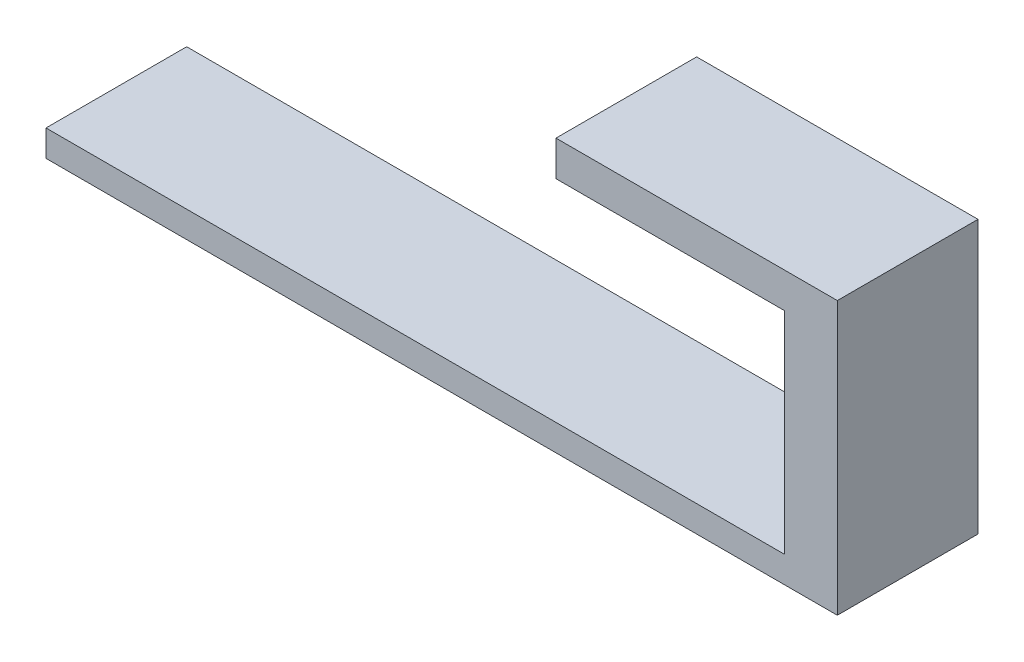
ISO-10303-21;
HEADER;
FILE_DESCRIPTION(('STEP AP214'),'2;1');
FILE_NAME('part.step','',(''),(''),'','','');
FILE_SCHEMA(('AUTOMOTIVE_DESIGN { 1 0 10303 214 1 1 1 1 }'));
ENDSEC;
DATA;
#1=APPLICATION_CONTEXT('core data for automotive mechanical design processes');
#2=APPLICATION_PROTOCOL_DEFINITION('international standard','automotive_design',2000,#1);
#3=PRODUCT_CONTEXT('',#1,'mechanical');
#4=PRODUCT('Part','Part','',(#3));
#5=PRODUCT_RELATED_PRODUCT_CATEGORY('part','',(#4));
#6=PRODUCT_DEFINITION_FORMATION('','',#4);
#7=PRODUCT_DEFINITION_CONTEXT('part definition',#1,'design');
#8=PRODUCT_DEFINITION('design','',#6,#7);
#9=PRODUCT_DEFINITION_SHAPE('','',#8);
#10=(LENGTH_UNIT() NAMED_UNIT(*) SI_UNIT(.MILLI.,.METRE.));
#11=(NAMED_UNIT(*) PLANE_ANGLE_UNIT() SI_UNIT($,.RADIAN.));
#12=(NAMED_UNIT(*) SI_UNIT($,.STERADIAN.) SOLID_ANGLE_UNIT());
#13=UNCERTAINTY_MEASURE_WITH_UNIT(LENGTH_MEASURE(1.E-05),#10,'distance_accuracy_value','');
#14=(GEOMETRIC_REPRESENTATION_CONTEXT(3) GLOBAL_UNCERTAINTY_ASSIGNED_CONTEXT((#13)) GLOBAL_UNIT_ASSIGNED_CONTEXT((#10,
#11,#12)) REPRESENTATION_CONTEXT('',''));
#15=CARTESIAN_POINT('',(0.,0.,0.));
#16=DIRECTION('',(0.,0.,1.));
#17=DIRECTION('',(1.,0.,0.));
#18=AXIS2_PLACEMENT_3D('',#15,#16,#17);
#19=CARTESIAN_POINT('',(19.5,15.5,-4.));
#20=DIRECTION('',(1.,0.,0.));
#21=DIRECTION('',(0.,0.,-1.));
#22=AXIS2_PLACEMENT_3D('',#19,#20,#21);
#23=PLANE('',#22);
#24=DIRECTION('',(0.,0.,1.));
#25=VECTOR('',#24,1.);
#26=CARTESIAN_POINT('',(19.5,13.5,-4.));
#27=LINE('',#26,#25);
#28=CARTESIAN_POINT('',(19.5,13.5,-4.));
#29=VERTEX_POINT('',#28);
#30=CARTESIAN_POINT('',(19.5,13.5,4.));
#31=VERTEX_POINT('',#30);
#32=EDGE_CURVE('E161',#29,#31,#27,.T.);
#33=ORIENTED_EDGE('',*,*,#32,.F.);
#34=DIRECTION('',(0.,-1.,0.));
#35=VECTOR('',#34,1.);
#36=CARTESIAN_POINT('',(19.5,15.5,-4.));
#37=LINE('',#36,#35);
#38=CARTESIAN_POINT('',(19.5,1.5,-4.));
#39=VERTEX_POINT('',#38);
#40=EDGE_CURVE('E48',#29,#39,#37,.T.);
#41=ORIENTED_EDGE('',*,*,#40,.T.);
#42=DIRECTION('',(0.,0.,1.));
#43=VECTOR('',#42,1.);
#44=CARTESIAN_POINT('',(19.5,1.5,-4.));
#45=LINE('',#44,#43);
#46=CARTESIAN_POINT('',(19.5,1.5,4.));
#47=VERTEX_POINT('',#46);
#48=EDGE_CURVE('E163',#39,#47,#45,.T.);
#49=ORIENTED_EDGE('',*,*,#48,.T.);
#50=DIRECTION('',(0.,-1.,0.));
#51=VECTOR('',#50,1.);
#52=CARTESIAN_POINT('',(19.5,15.5,4.));
#53=LINE('',#52,#51);
#54=EDGE_CURVE('E104',#31,#47,#53,.T.);
#55=ORIENTED_EDGE('',*,*,#54,.F.);
#56=EDGE_LOOP('',(#33,#41,#49,#55));
#57=FACE_BOUND('',#56,.T.);
#58=ADVANCED_FACE('F33',(#57),#23,.F.);
#59=CARTESIAN_POINT('',(0.,1.5,0.));
#60=DIRECTION('',(0.,-1.,0.));
#61=DIRECTION('',(0.,0.,-1.));
#62=AXIS2_PLACEMENT_3D('',#59,#60,#61);
#63=PLANE('',#62);
#64=ORIENTED_EDGE('',*,*,#48,.F.);
#65=DIRECTION('',(-1.,0.,0.));
#66=VECTOR('',#65,1.);
#67=CARTESIAN_POINT('',(-22.5,1.5,-4.));
#68=LINE('',#67,#66);
#69=CARTESIAN_POINT('',(-22.5,1.5,-4.));
#70=VERTEX_POINT('',#69);
#71=EDGE_CURVE('E88',#39,#70,#68,.T.);
#72=ORIENTED_EDGE('',*,*,#71,.T.);
#73=DIRECTION('',(0.,0.,1.));
#74=VECTOR('',#73,1.);
#75=CARTESIAN_POINT('',(-22.5,1.5,4.));
#76=LINE('',#75,#74);
#77=CARTESIAN_POINT('',(-22.5,1.5,4.));
#78=VERTEX_POINT('',#77);
#79=EDGE_CURVE('E57',#70,#78,#76,.T.);
#80=ORIENTED_EDGE('',*,*,#79,.T.);
#81=DIRECTION('',(1.,0.,0.));
#82=VECTOR('',#81,1.);
#83=CARTESIAN_POINT('',(-22.5,1.5,4.));
#84=LINE('',#83,#82);
#85=EDGE_CURVE('E98',#78,#47,#84,.T.);
#86=ORIENTED_EDGE('',*,*,#85,.T.);
#87=EDGE_LOOP('',(#64,#72,#80,#86));
#88=FACE_BOUND('',#87,.T.);
#89=ADVANCED_FACE('F174',(#88),#63,.F.);
#90=CARTESIAN_POINT('',(22.5,1.5,4.));
#91=DIRECTION('',(-1.,0.,0.));
#92=DIRECTION('',(0.,0.,1.));
#93=AXIS2_PLACEMENT_3D('',#90,#91,#92);
#94=PLANE('',#93);
#95=DIRECTION('',(0.,0.,-1.));
#96=VECTOR('',#95,1.);
#97=CARTESIAN_POINT('',(22.5,0.,4.));
#98=LINE('',#97,#96);
#99=CARTESIAN_POINT('',(22.5,0.,4.));
#100=VERTEX_POINT('',#99);
#101=CARTESIAN_POINT('',(22.5,0.,-4.));
#102=VERTEX_POINT('',#101);
#103=EDGE_CURVE('E95',#100,#102,#98,.T.);
#104=ORIENTED_EDGE('',*,*,#103,.T.);
#105=DIRECTION('',(0.,-1.,0.));
#106=VECTOR('',#105,1.);
#107=CARTESIAN_POINT('',(22.5,1.5,-4.));
#108=LINE('',#107,#106);
#109=CARTESIAN_POINT('',(22.5,15.5,-4.));
#110=VERTEX_POINT('',#109);
#111=EDGE_CURVE('E11',#110,#102,#108,.T.);
#112=ORIENTED_EDGE('',*,*,#111,.F.);
#113=DIRECTION('',(0.,0.,-1.));
#114=VECTOR('',#113,1.);
#115=CARTESIAN_POINT('',(22.5,15.5,-4.));
#116=LINE('',#115,#114);
#117=CARTESIAN_POINT('',(22.5,15.5,4.));
#118=VERTEX_POINT('',#117);
#119=EDGE_CURVE('E97',#118,#110,#116,.T.);
#120=ORIENTED_EDGE('',*,*,#119,.F.);
#121=DIRECTION('',(0.,-1.,0.));
#122=VECTOR('',#121,1.);
#123=CARTESIAN_POINT('',(22.5,1.5,4.));
#124=LINE('',#123,#122);
#125=EDGE_CURVE('E81',#118,#100,#124,.T.);
#126=ORIENTED_EDGE('',*,*,#125,.T.);
#127=EDGE_LOOP('',(#104,#112,#120,#126));
#128=FACE_BOUND('',#127,.T.);
#129=ADVANCED_FACE('F35',(#128),#94,.F.);
#130=CARTESIAN_POINT('',(-22.5,1.5,-4.));
#131=DIRECTION('',(0.,0.,1.));
#132=DIRECTION('',(1.,0.,0.));
#133=AXIS2_PLACEMENT_3D('',#130,#131,#132);
#134=PLANE('',#133);
#135=DIRECTION('',(-1.,0.,0.));
#136=VECTOR('',#135,1.);
#137=CARTESIAN_POINT('',(-22.5,0.,-4.));
#138=LINE('',#137,#136);
#139=CARTESIAN_POINT('',(-22.5,0.,-4.));
#140=VERTEX_POINT('',#139);
#141=EDGE_CURVE('E101',#102,#140,#138,.T.);
#142=ORIENTED_EDGE('',*,*,#141,.T.);
#143=DIRECTION('',(0.,-1.,0.));
#144=VECTOR('',#143,1.);
#145=CARTESIAN_POINT('',(-22.5,1.5,-4.));
#146=LINE('',#145,#144);
#147=EDGE_CURVE('E41',#70,#140,#146,.T.);
#148=ORIENTED_EDGE('',*,*,#147,.F.);
#149=ORIENTED_EDGE('',*,*,#71,.F.);
#150=ORIENTED_EDGE('',*,*,#40,.F.);
#151=DIRECTION('',(1.,0.,0.));
#152=VECTOR('',#151,1.);
#153=CARTESIAN_POINT('',(6.5,13.5,-4.));
#154=LINE('',#153,#152);
#155=CARTESIAN_POINT('',(6.5,13.5,-4.));
#156=VERTEX_POINT('',#155);
#157=EDGE_CURVE('E148',#156,#29,#154,.T.);
#158=ORIENTED_EDGE('',*,*,#157,.F.);
#159=DIRECTION('',(0.,-1.,0.));
#160=VECTOR('',#159,1.);
#161=CARTESIAN_POINT('',(6.5,15.5,-4.));
#162=LINE('',#161,#160);
#163=CARTESIAN_POINT('',(6.5,15.5,-4.));
#164=VERTEX_POINT('',#163);
#165=EDGE_CURVE('E155',#164,#156,#162,.T.);
#166=ORIENTED_EDGE('',*,*,#165,.F.);
#167=DIRECTION('',(-1.,0.,0.));
#168=VECTOR('',#167,1.);
#169=CARTESIAN_POINT('',(22.5,15.5,-4.));
#170=LINE('',#169,#168);
#171=EDGE_CURVE('E121',#110,#164,#170,.T.);
#172=ORIENTED_EDGE('',*,*,#171,.F.);
#173=ORIENTED_EDGE('',*,*,#111,.T.);
#174=EDGE_LOOP('',(#142,#148,#149,#150,#158,#166,#172,#173));
#175=FACE_BOUND('',#174,.T.);
#176=ADVANCED_FACE('F116',(#175),#134,.F.);
#177=CARTESIAN_POINT('',(-22.5,1.5,4.));
#178=DIRECTION('',(1.,0.,0.));
#179=DIRECTION('',(0.,0.,-1.));
#180=AXIS2_PLACEMENT_3D('',#177,#178,#179);
#181=PLANE('',#180);
#182=DIRECTION('',(0.,0.,1.));
#183=VECTOR('',#182,1.);
#184=CARTESIAN_POINT('',(-22.5,0.,4.));
#185=LINE('',#184,#183);
#186=CARTESIAN_POINT('',(-22.5,0.,4.));
#187=VERTEX_POINT('',#186);
#188=EDGE_CURVE('E89',#140,#187,#185,.T.);
#189=ORIENTED_EDGE('',*,*,#188,.T.);
#190=DIRECTION('',(0.,-1.,0.));
#191=VECTOR('',#190,1.);
#192=CARTESIAN_POINT('',(-22.5,1.5,4.));
#193=LINE('',#192,#191);
#194=EDGE_CURVE('E84',#78,#187,#193,.T.);
#195=ORIENTED_EDGE('',*,*,#194,.F.);
#196=ORIENTED_EDGE('',*,*,#79,.F.);
#197=ORIENTED_EDGE('',*,*,#147,.T.);
#198=EDGE_LOOP('',(#189,#195,#196,#197));
#199=FACE_BOUND('',#198,.T.);
#200=ADVANCED_FACE('F113',(#199),#181,.F.);
#201=CARTESIAN_POINT('',(-22.5,1.5,4.));
#202=DIRECTION('',(0.,0.,-1.));
#203=DIRECTION('',(-1.,0.,0.));
#204=AXIS2_PLACEMENT_3D('',#201,#202,#203);
#205=PLANE('',#204);
#206=DIRECTION('',(1.,0.,0.));
#207=VECTOR('',#206,1.);
#208=CARTESIAN_POINT('',(-22.5,0.,4.));
#209=LINE('',#208,#207);
#210=EDGE_CURVE('E77',#187,#100,#209,.T.);
#211=ORIENTED_EDGE('',*,*,#210,.T.);
#212=ORIENTED_EDGE('',*,*,#125,.F.);
#213=DIRECTION('',(1.,0.,0.));
#214=VECTOR('',#213,1.);
#215=CARTESIAN_POINT('',(22.5,15.5,4.));
#216=LINE('',#215,#214);
#217=CARTESIAN_POINT('',(6.5,15.5,4.));
#218=VERTEX_POINT('',#217);
#219=EDGE_CURVE('E171',#218,#118,#216,.T.);
#220=ORIENTED_EDGE('',*,*,#219,.F.);
#221=DIRECTION('',(0.,1.,0.));
#222=VECTOR('',#221,1.);
#223=CARTESIAN_POINT('',(6.5,15.5,4.));
#224=LINE('',#223,#222);
#225=CARTESIAN_POINT('',(6.5,13.5,4.));
#226=VERTEX_POINT('',#225);
#227=EDGE_CURVE('E154',#226,#218,#224,.T.);
#228=ORIENTED_EDGE('',*,*,#227,.F.);
#229=DIRECTION('',(1.,0.,0.));
#230=VECTOR('',#229,1.);
#231=CARTESIAN_POINT('',(6.5,13.5,4.));
#232=LINE('',#231,#230);
#233=EDGE_CURVE('E150',#226,#31,#232,.T.);
#234=ORIENTED_EDGE('',*,*,#233,.T.);
#235=ORIENTED_EDGE('',*,*,#54,.T.);
#236=ORIENTED_EDGE('',*,*,#85,.F.);
#237=ORIENTED_EDGE('',*,*,#194,.T.);
#238=EDGE_LOOP('',(#211,#212,#220,#228,#234,#235,#236,#237));
#239=FACE_BOUND('',#238,.T.);
#240=ADVANCED_FACE('F79',(#239),#205,.F.);
#241=CARTESIAN_POINT('',(0.,0.,0.));
#242=DIRECTION('',(0.,-1.,0.));
#243=DIRECTION('',(0.,0.,-1.));
#244=AXIS2_PLACEMENT_3D('',#241,#242,#243);
#245=PLANE('',#244);
#246=ORIENTED_EDGE('',*,*,#103,.F.);
#247=ORIENTED_EDGE('',*,*,#210,.F.);
#248=ORIENTED_EDGE('',*,*,#188,.F.);
#249=ORIENTED_EDGE('',*,*,#141,.F.);
#250=EDGE_LOOP('',(#246,#247,#248,#249));
#251=FACE_BOUND('',#250,.T.);
#252=ADVANCED_FACE('F100',(#251),#245,.T.);
#253=CARTESIAN_POINT('',(0.,15.5,0.));
#254=DIRECTION('',(0.,-1.,0.));
#255=DIRECTION('',(0.,0.,-1.));
#256=AXIS2_PLACEMENT_3D('',#253,#254,#255);
#257=PLANE('',#256);
#258=ORIENTED_EDGE('',*,*,#119,.T.);
#259=ORIENTED_EDGE('',*,*,#171,.T.);
#260=DIRECTION('',(0.,0.,-1.));
#261=VECTOR('',#260,1.);
#262=CARTESIAN_POINT('',(6.5,15.5,-4.));
#263=LINE('',#262,#261);
#264=EDGE_CURVE('E160',#218,#164,#263,.T.);
#265=ORIENTED_EDGE('',*,*,#264,.F.);
#266=ORIENTED_EDGE('',*,*,#219,.T.);
#267=EDGE_LOOP('',(#258,#259,#265,#266));
#268=FACE_BOUND('',#267,.T.);
#269=ADVANCED_FACE('F179',(#268),#257,.F.);
#270=CARTESIAN_POINT('',(6.5,13.5,-4.));
#271=DIRECTION('',(0.,1.,0.));
#272=DIRECTION('',(0.,0.,1.));
#273=AXIS2_PLACEMENT_3D('',#270,#271,#272);
#274=PLANE('',#273);
#275=ORIENTED_EDGE('',*,*,#32,.T.);
#276=ORIENTED_EDGE('',*,*,#233,.F.);
#277=DIRECTION('',(0.,0.,1.));
#278=VECTOR('',#277,1.);
#279=CARTESIAN_POINT('',(6.5,13.5,-4.));
#280=LINE('',#279,#278);
#281=EDGE_CURVE('E144',#156,#226,#280,.T.);
#282=ORIENTED_EDGE('',*,*,#281,.F.);
#283=ORIENTED_EDGE('',*,*,#157,.T.);
#284=EDGE_LOOP('',(#275,#276,#282,#283));
#285=FACE_BOUND('',#284,.T.);
#286=ADVANCED_FACE('F146',(#285),#274,.F.);
#287=CARTESIAN_POINT('',(6.5,0.,0.));
#288=DIRECTION('',(-1.,0.,0.));
#289=DIRECTION('',(0.,0.,1.));
#290=AXIS2_PLACEMENT_3D('',#287,#288,#289);
#291=PLANE('',#290);
#292=ORIENTED_EDGE('',*,*,#165,.T.);
#293=ORIENTED_EDGE('',*,*,#281,.T.);
#294=ORIENTED_EDGE('',*,*,#227,.T.);
#295=ORIENTED_EDGE('',*,*,#264,.T.);
#296=EDGE_LOOP('',(#292,#293,#294,#295));
#297=FACE_BOUND('',#296,.T.);
#298=ADVANCED_FACE('F158',(#297),#291,.T.);
#299=CLOSED_SHELL('',(#58,#89,#129,#176,#200,#240,#252,#269,#286,#298));
#300=MANIFOLD_SOLID_BREP('B2',#299);
#301=ADVANCED_BREP_SHAPE_REPRESENTATION('',(#18,#300),#14);
#302=SHAPE_DEFINITION_REPRESENTATION(#9,#301);
ENDSEC;
END-ISO-10303-21;
